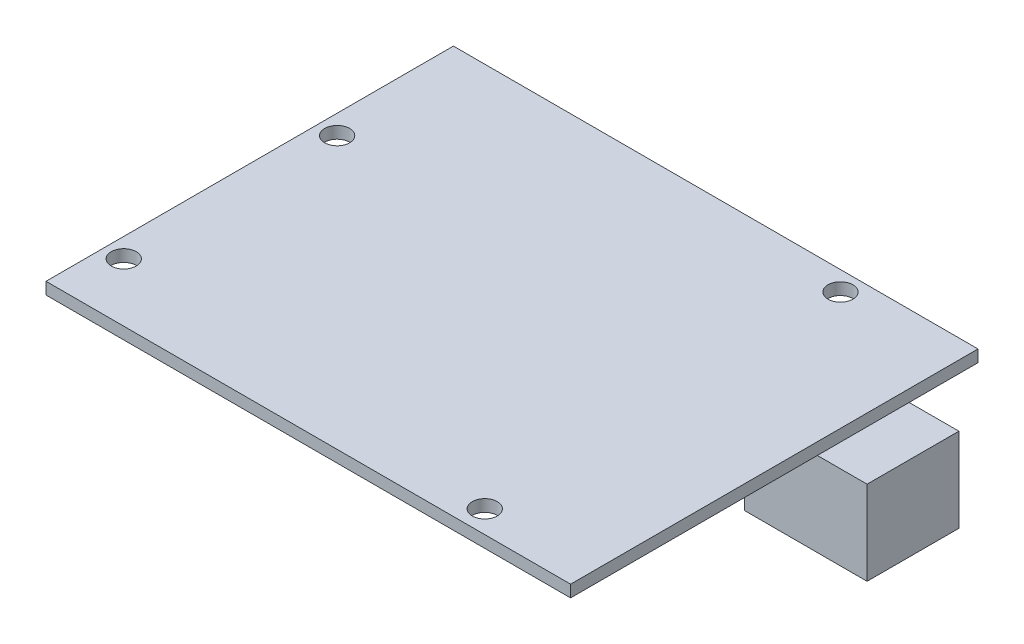
ISO-10303-21;
HEADER;
FILE_DESCRIPTION(('STEP AP214'),'2;1');
FILE_NAME('part.step','',(''),(''),'','','');
FILE_SCHEMA(('AUTOMOTIVE_DESIGN { 1 0 10303 214 1 1 1 1 }'));
ENDSEC;
DATA;
#1=APPLICATION_CONTEXT('core data for automotive mechanical design processes');
#2=APPLICATION_PROTOCOL_DEFINITION('international standard','automotive_design',2000,#1);
#3=PRODUCT_CONTEXT('',#1,'mechanical');
#4=PRODUCT('Part','Part','',(#3));
#5=PRODUCT_RELATED_PRODUCT_CATEGORY('part','',(#4));
#6=PRODUCT_DEFINITION_FORMATION('','',#4);
#7=PRODUCT_DEFINITION_CONTEXT('part definition',#1,'design');
#8=PRODUCT_DEFINITION('design','',#6,#7);
#9=PRODUCT_DEFINITION_SHAPE('','',#8);
#10=(LENGTH_UNIT() NAMED_UNIT(*) SI_UNIT(.MILLI.,.METRE.));
#11=(NAMED_UNIT(*) PLANE_ANGLE_UNIT() SI_UNIT($,.RADIAN.));
#12=(NAMED_UNIT(*) SI_UNIT($,.STERADIAN.) SOLID_ANGLE_UNIT());
#13=UNCERTAINTY_MEASURE_WITH_UNIT(LENGTH_MEASURE(1.E-05),#10,'distance_accuracy_value','');
#14=(GEOMETRIC_REPRESENTATION_CONTEXT(3) GLOBAL_UNCERTAINTY_ASSIGNED_CONTEXT((#13)) GLOBAL_UNIT_ASSIGNED_CONTEXT((#10,
#11,#12)) REPRESENTATION_CONTEXT('',''));
#15=CARTESIAN_POINT('',(0.,0.,0.));
#16=DIRECTION('',(0.,0.,1.));
#17=DIRECTION('',(1.,0.,0.));
#18=AXIS2_PLACEMENT_3D('',#15,#16,#17);
#19=CARTESIAN_POINT('',(0.,1.56,0.));
#20=DIRECTION('',(0.,-1.,0.));
#21=DIRECTION('',(0.,0.,-1.));
#22=AXIS2_PLACEMENT_3D('',#19,#20,#21);
#23=PLANE('',#22);
#24=DIRECTION('',(0.,0.,1.));
#25=VECTOR('',#24,1.);
#26=CARTESIAN_POINT('',(-2.54,1.56,-45.64));
#27=LINE('',#26,#25);
#28=CARTESIAN_POINT('',(-2.54,1.56,-45.64));
#29=VERTEX_POINT('',#28);
#30=CARTESIAN_POINT('',(-2.53999999999999,1.56,7.62));
#31=VERTEX_POINT('',#30);
#32=EDGE_CURVE('E160',#29,#31,#27,.T.);
#33=ORIENTED_EDGE('',*,*,#32,.T.);
#34=DIRECTION('',(1.,0.,0.));
#35=VECTOR('',#34,1.);
#36=CARTESIAN_POINT('',(66.04,1.56,7.61999999999999));
#37=LINE('',#36,#35);
#38=CARTESIAN_POINT('',(66.04,1.56,7.61999999999999));
#39=VERTEX_POINT('',#38);
#40=EDGE_CURVE('E163',#31,#39,#37,.T.);
#41=ORIENTED_EDGE('',*,*,#40,.T.);
#42=DIRECTION('',(0.,0.,-1.));
#43=VECTOR('',#42,1.);
#44=CARTESIAN_POINT('',(66.04,1.56,-45.64));
#45=LINE('',#44,#43);
#46=CARTESIAN_POINT('',(66.04,1.56,-45.64));
#47=VERTEX_POINT('',#46);
#48=EDGE_CURVE('E166',#39,#47,#45,.T.);
#49=ORIENTED_EDGE('',*,*,#48,.T.);
#50=DIRECTION('',(-1.,0.,0.));
#51=VECTOR('',#50,1.);
#52=CARTESIAN_POINT('',(66.04,1.56,-45.64));
#53=LINE('',#52,#51);
#54=EDGE_CURVE('E168',#47,#29,#53,.T.);
#55=ORIENTED_EDGE('',*,*,#54,.T.);
#56=EDGE_LOOP('',(#33,#41,#49,#55));
#57=FACE_BOUND('',#56,.T.);
#58=CARTESIAN_POINT('',(0.,1.56,0.));
#59=DIRECTION('',(0.,1.,0.));
#60=DIRECTION('',(0.,0.,1.));
#61=AXIS2_PLACEMENT_3D('',#58,#59,#60);
#62=CIRCLE('',#61,1.63195);
#63=CARTESIAN_POINT('',(0.,1.56,1.63195));
#64=VERTEX_POINT('',#63);
#65=EDGE_CURVE('E154',#64,#64,#62,.T.);
#66=ORIENTED_EDGE('',*,*,#65,.F.);
#67=EDGE_LOOP('',(#66));
#68=FACE_BOUND('',#67,.T.);
#69=CARTESIAN_POINT('',(0.,1.56,-27.9));
#70=DIRECTION('',(0.,1.,0.));
#71=DIRECTION('',(0.,0.,1.));
#72=AXIS2_PLACEMENT_3D('',#69,#70,#71);
#73=CIRCLE('',#72,1.63195);
#74=CARTESIAN_POINT('',(0.,1.56,-26.26805));
#75=VERTEX_POINT('',#74);
#76=EDGE_CURVE('E148',#75,#75,#73,.T.);
#77=ORIENTED_EDGE('',*,*,#76,.F.);
#78=EDGE_LOOP('',(#77));
#79=FACE_BOUND('',#78,.T.);
#80=CARTESIAN_POINT('',(51.9,1.56,4.7));
#81=DIRECTION('',(0.,1.,0.));
#82=DIRECTION('',(0.,0.,1.));
#83=AXIS2_PLACEMENT_3D('',#80,#81,#82);
#84=CIRCLE('',#83,1.63194999999999);
#85=CARTESIAN_POINT('',(51.9,1.56,6.33194999999999));
#86=VERTEX_POINT('',#85);
#87=EDGE_CURVE('E142',#86,#86,#84,.T.);
#88=ORIENTED_EDGE('',*,*,#87,.F.);
#89=EDGE_LOOP('',(#88));
#90=FACE_BOUND('',#89,.T.);
#91=CARTESIAN_POINT('',(50.6,1.56,-43.1));
#92=DIRECTION('',(0.,1.,0.));
#93=DIRECTION('',(0.,0.,1.));
#94=AXIS2_PLACEMENT_3D('',#91,#92,#93);
#95=CIRCLE('',#94,1.63195);
#96=CARTESIAN_POINT('',(50.6,1.56,-41.46805));
#97=VERTEX_POINT('',#96);
#98=EDGE_CURVE('E133',#97,#97,#95,.T.);
#99=ORIENTED_EDGE('',*,*,#98,.F.);
#100=EDGE_LOOP('',(#99));
#101=FACE_BOUND('',#100,.T.);
#102=ADVANCED_FACE('F33',(#57,#68,#79,#90,#101),#23,.F.);
#103=CARTESIAN_POINT('',(0.,0.,0.));
#104=DIRECTION('',(0.,-1.,0.));
#105=DIRECTION('',(0.,0.,-1.));
#106=AXIS2_PLACEMENT_3D('',#103,#104,#105);
#107=PLANE('',#106);
#108=DIRECTION('',(1.,0.,0.));
#109=VECTOR('',#108,1.);
#110=CARTESIAN_POINT('',(56.54,0.,-36.64));
#111=LINE('',#110,#109);
#112=CARTESIAN_POINT('',(56.54,0.,-36.64));
#113=VERTEX_POINT('',#112);
#114=CARTESIAN_POINT('',(66.04,0.,-36.64));
#115=VERTEX_POINT('',#114);
#116=EDGE_CURVE('E50',#113,#115,#111,.T.);
#117=ORIENTED_EDGE('',*,*,#116,.F.);
#118=DIRECTION('',(0.,0.,-1.));
#119=VECTOR('',#118,1.);
#120=CARTESIAN_POINT('',(56.54,0.,-24.64));
#121=LINE('',#120,#119);
#122=CARTESIAN_POINT('',(56.54,0.,-24.64));
#123=VERTEX_POINT('',#122);
#124=EDGE_CURVE('E206',#123,#113,#121,.T.);
#125=ORIENTED_EDGE('',*,*,#124,.F.);
#126=DIRECTION('',(-1.,0.,0.));
#127=VECTOR('',#126,1.);
#128=CARTESIAN_POINT('',(56.54,0.,-24.64));
#129=LINE('',#128,#127);
#130=CARTESIAN_POINT('',(66.04,0.,-24.64));
#131=VERTEX_POINT('',#130);
#132=EDGE_CURVE('E11',#131,#123,#129,.T.);
#133=ORIENTED_EDGE('',*,*,#132,.F.);
#134=DIRECTION('',(0.,0.,-1.));
#135=VECTOR('',#134,1.);
#136=CARTESIAN_POINT('',(66.04,0.,-45.64));
#137=LINE('',#136,#135);
#138=CARTESIAN_POINT('',(66.04,0.,7.61999999999999));
#139=VERTEX_POINT('',#138);
#140=EDGE_CURVE('E175',#139,#131,#137,.T.);
#141=ORIENTED_EDGE('',*,*,#140,.F.);
#142=DIRECTION('',(1.,0.,0.));
#143=VECTOR('',#142,1.);
#144=CARTESIAN_POINT('',(66.04,0.,7.61999999999999));
#145=LINE('',#144,#143);
#146=CARTESIAN_POINT('',(-2.53999999999999,0.,7.62));
#147=VERTEX_POINT('',#146);
#148=EDGE_CURVE('E173',#147,#139,#145,.T.);
#149=ORIENTED_EDGE('',*,*,#148,.F.);
#150=DIRECTION('',(0.,0.,1.));
#151=VECTOR('',#150,1.);
#152=CARTESIAN_POINT('',(-2.54,0.,-45.64));
#153=LINE('',#152,#151);
#154=CARTESIAN_POINT('',(-2.54,0.,-45.64));
#155=VERTEX_POINT('',#154);
#156=EDGE_CURVE('E157',#155,#147,#153,.T.);
#157=ORIENTED_EDGE('',*,*,#156,.F.);
#158=DIRECTION('',(-1.,0.,0.));
#159=VECTOR('',#158,1.);
#160=CARTESIAN_POINT('',(66.04,0.,-45.64));
#161=LINE('',#160,#159);
#162=CARTESIAN_POINT('',(66.04,0.,-45.64));
#163=VERTEX_POINT('',#162);
#164=EDGE_CURVE('E164',#163,#155,#161,.T.);
#165=ORIENTED_EDGE('',*,*,#164,.F.);
#166=EDGE_CURVE('E55',#115,#163,#137,.T.);
#167=ORIENTED_EDGE('',*,*,#166,.F.);
#168=EDGE_LOOP('',(#117,#125,#133,#141,#149,#157,#165,#167));
#169=FACE_BOUND('',#168,.T.);
#170=CARTESIAN_POINT('',(51.9,0.,4.7));
#171=DIRECTION('',(0.,1.,0.));
#172=DIRECTION('',(0.,0.,1.));
#173=AXIS2_PLACEMENT_3D('',#170,#171,#172);
#174=CIRCLE('',#173,1.63194999999999);
#175=CARTESIAN_POINT('',(51.9,0.,6.33194999999999));
#176=VERTEX_POINT('',#175);
#177=EDGE_CURVE('E140',#176,#176,#174,.T.);
#178=ORIENTED_EDGE('',*,*,#177,.T.);
#179=EDGE_LOOP('',(#178));
#180=FACE_BOUND('',#179,.T.);
#181=CARTESIAN_POINT('',(0.,0.,0.));
#182=DIRECTION('',(0.,1.,0.));
#183=DIRECTION('',(0.,0.,1.));
#184=AXIS2_PLACEMENT_3D('',#181,#182,#183);
#185=CIRCLE('',#184,1.63195);
#186=CARTESIAN_POINT('',(0.,0.,1.63195));
#187=VERTEX_POINT('',#186);
#188=EDGE_CURVE('E151',#187,#187,#185,.T.);
#189=ORIENTED_EDGE('',*,*,#188,.T.);
#190=EDGE_LOOP('',(#189));
#191=FACE_BOUND('',#190,.T.);
#192=CARTESIAN_POINT('',(0.,0.,-27.9));
#193=DIRECTION('',(0.,1.,0.));
#194=DIRECTION('',(0.,0.,1.));
#195=AXIS2_PLACEMENT_3D('',#192,#193,#194);
#196=CIRCLE('',#195,1.63195);
#197=CARTESIAN_POINT('',(0.,0.,-26.26805));
#198=VERTEX_POINT('',#197);
#199=EDGE_CURVE('E145',#198,#198,#196,.T.);
#200=ORIENTED_EDGE('',*,*,#199,.T.);
#201=EDGE_LOOP('',(#200));
#202=FACE_BOUND('',#201,.T.);
#203=CARTESIAN_POINT('',(50.6,0.,-43.1));
#204=DIRECTION('',(0.,1.,0.));
#205=DIRECTION('',(0.,0.,1.));
#206=AXIS2_PLACEMENT_3D('',#203,#204,#205);
#207=CIRCLE('',#206,1.63195);
#208=CARTESIAN_POINT('',(50.6,0.,-41.46805));
#209=VERTEX_POINT('',#208);
#210=EDGE_CURVE('E130',#209,#209,#207,.T.);
#211=ORIENTED_EDGE('',*,*,#210,.T.);
#212=EDGE_LOOP('',(#211));
#213=FACE_BOUND('',#212,.T.);
#214=ADVANCED_FACE('F198',(#169,#180,#191,#202,#213),#107,.T.);
#215=CARTESIAN_POINT('',(-2.54,1.56,-45.64));
#216=DIRECTION('',(1.,0.,0.));
#217=DIRECTION('',(0.,0.,-1.));
#218=AXIS2_PLACEMENT_3D('',#215,#216,#217);
#219=PLANE('',#218);
#220=ORIENTED_EDGE('',*,*,#156,.T.);
#221=DIRECTION('',(0.,-1.,0.));
#222=VECTOR('',#221,1.);
#223=CARTESIAN_POINT('',(-2.53999999999999,1.56,7.62));
#224=LINE('',#223,#222);
#225=EDGE_CURVE('E37',#31,#147,#224,.T.);
#226=ORIENTED_EDGE('',*,*,#225,.F.);
#227=ORIENTED_EDGE('',*,*,#32,.F.);
#228=DIRECTION('',(0.,-1.,0.));
#229=VECTOR('',#228,1.);
#230=CARTESIAN_POINT('',(-2.54,1.56,-45.64));
#231=LINE('',#230,#229);
#232=EDGE_CURVE('E170',#29,#155,#231,.T.);
#233=ORIENTED_EDGE('',*,*,#232,.T.);
#234=EDGE_LOOP('',(#220,#226,#227,#233));
#235=FACE_BOUND('',#234,.T.);
#236=ADVANCED_FACE('F35',(#235),#219,.F.);
#237=CARTESIAN_POINT('',(66.04,1.56,7.61999999999999));
#238=DIRECTION('',(0.,0.,-1.));
#239=DIRECTION('',(-1.,0.,0.));
#240=AXIS2_PLACEMENT_3D('',#237,#238,#239);
#241=PLANE('',#240);
#242=ORIENTED_EDGE('',*,*,#148,.T.);
#243=DIRECTION('',(0.,-1.,0.));
#244=VECTOR('',#243,1.);
#245=CARTESIAN_POINT('',(66.04,1.56,7.61999999999999));
#246=LINE('',#245,#244);
#247=EDGE_CURVE('E184',#39,#139,#246,.T.);
#248=ORIENTED_EDGE('',*,*,#247,.F.);
#249=ORIENTED_EDGE('',*,*,#40,.F.);
#250=ORIENTED_EDGE('',*,*,#225,.T.);
#251=EDGE_LOOP('',(#242,#248,#249,#250));
#252=FACE_BOUND('',#251,.T.);
#253=ADVANCED_FACE('F193',(#252),#241,.F.);
#254=CARTESIAN_POINT('',(66.04,1.56,-45.64));
#255=DIRECTION('',(-1.,0.,0.));
#256=DIRECTION('',(0.,0.,1.));
#257=AXIS2_PLACEMENT_3D('',#254,#255,#256);
#258=PLANE('',#257);
#259=ORIENTED_EDGE('',*,*,#140,.T.);
#260=EDGE_CURVE('E178',#131,#115,#137,.T.);
#261=ORIENTED_EDGE('',*,*,#260,.T.);
#262=ORIENTED_EDGE('',*,*,#166,.T.);
#263=DIRECTION('',(0.,-1.,0.));
#264=VECTOR('',#263,1.);
#265=CARTESIAN_POINT('',(66.04,1.56,-45.64));
#266=LINE('',#265,#264);
#267=EDGE_CURVE('E182',#47,#163,#266,.T.);
#268=ORIENTED_EDGE('',*,*,#267,.F.);
#269=ORIENTED_EDGE('',*,*,#48,.F.);
#270=ORIENTED_EDGE('',*,*,#247,.T.);
#271=EDGE_LOOP('',(#259,#261,#262,#268,#269,#270));
#272=FACE_BOUND('',#271,.T.);
#273=ADVANCED_FACE('F201',(#272),#258,.F.);
#274=CARTESIAN_POINT('',(66.04,1.56,-45.64));
#275=DIRECTION('',(0.,0.,1.));
#276=DIRECTION('',(1.,0.,0.));
#277=AXIS2_PLACEMENT_3D('',#274,#275,#276);
#278=PLANE('',#277);
#279=ORIENTED_EDGE('',*,*,#164,.T.);
#280=ORIENTED_EDGE('',*,*,#232,.F.);
#281=ORIENTED_EDGE('',*,*,#54,.F.);
#282=ORIENTED_EDGE('',*,*,#267,.T.);
#283=EDGE_LOOP('',(#279,#280,#281,#282));
#284=FACE_BOUND('',#283,.T.);
#285=ADVANCED_FACE('F240',(#284),#278,.F.);
#286=CARTESIAN_POINT('',(0.,1.56,0.));
#287=DIRECTION('',(0.,-1.,0.));
#288=DIRECTION('',(0.,0.,-1.));
#289=AXIS2_PLACEMENT_3D('',#286,#287,#288);
#290=CYLINDRICAL_SURFACE('',#289,1.63195);
#291=ORIENTED_EDGE('',*,*,#65,.T.);
#292=EDGE_LOOP('',(#291));
#293=FACE_BOUND('',#292,.T.);
#294=ORIENTED_EDGE('',*,*,#188,.F.);
#295=EDGE_LOOP('',(#294));
#296=FACE_BOUND('',#295,.T.);
#297=ADVANCED_FACE('F237',(#293,#296),#290,.F.);
#298=CARTESIAN_POINT('',(0.,1.56,-27.9));
#299=DIRECTION('',(0.,-1.,0.));
#300=DIRECTION('',(0.,0.,-1.));
#301=AXIS2_PLACEMENT_3D('',#298,#299,#300);
#302=CYLINDRICAL_SURFACE('',#301,1.63195);
#303=ORIENTED_EDGE('',*,*,#76,.T.);
#304=EDGE_LOOP('',(#303));
#305=FACE_BOUND('',#304,.T.);
#306=ORIENTED_EDGE('',*,*,#199,.F.);
#307=EDGE_LOOP('',(#306));
#308=FACE_BOUND('',#307,.T.);
#309=ADVANCED_FACE('F321',(#305,#308),#302,.F.);
#310=CARTESIAN_POINT('',(51.9,1.56,4.7));
#311=DIRECTION('',(0.,-1.,0.));
#312=DIRECTION('',(0.,0.,-1.));
#313=AXIS2_PLACEMENT_3D('',#310,#311,#312);
#314=CYLINDRICAL_SURFACE('',#313,1.63194999999999);
#315=ORIENTED_EDGE('',*,*,#87,.T.);
#316=EDGE_LOOP('',(#315));
#317=FACE_BOUND('',#316,.T.);
#318=ORIENTED_EDGE('',*,*,#177,.F.);
#319=EDGE_LOOP('',(#318));
#320=FACE_BOUND('',#319,.T.);
#321=ADVANCED_FACE('F316',(#317,#320),#314,.F.);
#322=CARTESIAN_POINT('',(50.6,1.56,-43.1));
#323=DIRECTION('',(0.,-1.,0.));
#324=DIRECTION('',(0.,0.,-1.));
#325=AXIS2_PLACEMENT_3D('',#322,#323,#324);
#326=CYLINDRICAL_SURFACE('',#325,1.63195);
#327=ORIENTED_EDGE('',*,*,#98,.T.);
#328=EDGE_LOOP('',(#327));
#329=FACE_BOUND('',#328,.T.);
#330=ORIENTED_EDGE('',*,*,#210,.F.);
#331=EDGE_LOOP('',(#330));
#332=FACE_BOUND('',#331,.T.);
#333=ADVANCED_FACE('F262',(#329,#332),#326,.F.);
#334=CARTESIAN_POINT('',(72.54,-11.,-24.64));
#335=DIRECTION('',(-1.,0.,0.));
#336=DIRECTION('',(0.,0.,1.));
#337=AXIS2_PLACEMENT_3D('',#334,#335,#336);
#338=PLANE('',#337);
#339=DIRECTION('',(0.,0.,1.));
#340=VECTOR('',#339,1.);
#341=CARTESIAN_POINT('',(72.54,0.,-24.64));
#342=LINE('',#341,#340);
#343=CARTESIAN_POINT('',(72.54,0.,-36.64));
#344=VERTEX_POINT('',#343);
#345=CARTESIAN_POINT('',(72.54,0.,-24.64));
#346=VERTEX_POINT('',#345);
#347=EDGE_CURVE('E129',#344,#346,#342,.T.);
#348=ORIENTED_EDGE('',*,*,#347,.T.);
#349=DIRECTION('',(0.,1.,0.));
#350=VECTOR('',#349,1.);
#351=CARTESIAN_POINT('',(72.54,-11.,-24.64));
#352=LINE('',#351,#350);
#353=CARTESIAN_POINT('',(72.54,-11.,-24.64));
#354=VERTEX_POINT('',#353);
#355=EDGE_CURVE('E110',#354,#346,#352,.T.);
#356=ORIENTED_EDGE('',*,*,#355,.F.);
#357=DIRECTION('',(0.,0.,1.));
#358=VECTOR('',#357,1.);
#359=CARTESIAN_POINT('',(72.54,-11.,-24.64));
#360=LINE('',#359,#358);
#361=CARTESIAN_POINT('',(72.54,-11.,-36.64));
#362=VERTEX_POINT('',#361);
#363=EDGE_CURVE('E117',#362,#354,#360,.T.);
#364=ORIENTED_EDGE('',*,*,#363,.F.);
#365=DIRECTION('',(0.,1.,0.));
#366=VECTOR('',#365,1.);
#367=CARTESIAN_POINT('',(72.54,-11.,-36.64));
#368=LINE('',#367,#366);
#369=EDGE_CURVE('E212',#362,#344,#368,.T.);
#370=ORIENTED_EDGE('',*,*,#369,.T.);
#371=EDGE_LOOP('',(#348,#356,#364,#370));
#372=FACE_BOUND('',#371,.T.);
#373=ADVANCED_FACE('F127',(#372),#338,.F.);
#374=CARTESIAN_POINT('',(56.54,-11.,-24.64));
#375=DIRECTION('',(0.,0.,-1.));
#376=DIRECTION('',(-1.,0.,0.));
#377=AXIS2_PLACEMENT_3D('',#374,#375,#376);
#378=PLANE('',#377);
#379=EDGE_CURVE('E43',#346,#131,#129,.T.);
#380=ORIENTED_EDGE('',*,*,#379,.T.);
#381=ORIENTED_EDGE('',*,*,#132,.T.);
#382=DIRECTION('',(0.,1.,0.));
#383=VECTOR('',#382,1.);
#384=CARTESIAN_POINT('',(56.54,-11.,-24.64));
#385=LINE('',#384,#383);
#386=CARTESIAN_POINT('',(56.54,-11.,-24.64));
#387=VERTEX_POINT('',#386);
#388=EDGE_CURVE('E113',#387,#123,#385,.T.);
#389=ORIENTED_EDGE('',*,*,#388,.F.);
#390=DIRECTION('',(-1.,0.,0.));
#391=VECTOR('',#390,1.);
#392=CARTESIAN_POINT('',(56.54,-11.,-24.64));
#393=LINE('',#392,#391);
#394=EDGE_CURVE('E105',#354,#387,#393,.T.);
#395=ORIENTED_EDGE('',*,*,#394,.F.);
#396=ORIENTED_EDGE('',*,*,#355,.T.);
#397=EDGE_LOOP('',(#380,#381,#389,#395,#396));
#398=FACE_BOUND('',#397,.T.);
#399=ADVANCED_FACE('F108',(#398),#378,.F.);
#400=CARTESIAN_POINT('',(56.54,-11.,-24.64));
#401=DIRECTION('',(1.,0.,0.));
#402=DIRECTION('',(0.,0.,-1.));
#403=AXIS2_PLACEMENT_3D('',#400,#401,#402);
#404=PLANE('',#403);
#405=ORIENTED_EDGE('',*,*,#124,.T.);
#406=DIRECTION('',(0.,1.,0.));
#407=VECTOR('',#406,1.);
#408=CARTESIAN_POINT('',(56.54,-11.,-36.64));
#409=LINE('',#408,#407);
#410=CARTESIAN_POINT('',(56.54,-11.,-36.64));
#411=VERTEX_POINT('',#410);
#412=EDGE_CURVE('E135',#411,#113,#409,.T.);
#413=ORIENTED_EDGE('',*,*,#412,.F.);
#414=DIRECTION('',(0.,0.,-1.));
#415=VECTOR('',#414,1.);
#416=CARTESIAN_POINT('',(56.54,-11.,-24.64));
#417=LINE('',#416,#415);
#418=EDGE_CURVE('E116',#387,#411,#417,.T.);
#419=ORIENTED_EDGE('',*,*,#418,.F.);
#420=ORIENTED_EDGE('',*,*,#388,.T.);
#421=EDGE_LOOP('',(#405,#413,#419,#420));
#422=FACE_BOUND('',#421,.T.);
#423=ADVANCED_FACE('F218',(#422),#404,.F.);
#424=CARTESIAN_POINT('',(56.54,-11.,-36.64));
#425=DIRECTION('',(0.,0.,1.));
#426=DIRECTION('',(1.,0.,0.));
#427=AXIS2_PLACEMENT_3D('',#424,#425,#426);
#428=PLANE('',#427);
#429=ORIENTED_EDGE('',*,*,#116,.T.);
#430=EDGE_CURVE('E205',#115,#344,#111,.T.);
#431=ORIENTED_EDGE('',*,*,#430,.T.);
#432=ORIENTED_EDGE('',*,*,#369,.F.);
#433=DIRECTION('',(1.,0.,0.));
#434=VECTOR('',#433,1.);
#435=CARTESIAN_POINT('',(56.54,-11.,-36.64));
#436=LINE('',#435,#434);
#437=EDGE_CURVE('E122',#411,#362,#436,.T.);
#438=ORIENTED_EDGE('',*,*,#437,.F.);
#439=ORIENTED_EDGE('',*,*,#412,.T.);
#440=EDGE_LOOP('',(#429,#431,#432,#438,#439));
#441=FACE_BOUND('',#440,.T.);
#442=ADVANCED_FACE('F216',(#441),#428,.F.);
#443=CARTESIAN_POINT('',(0.,-11.,0.));
#444=DIRECTION('',(0.,-1.,0.));
#445=DIRECTION('',(0.,0.,-1.));
#446=AXIS2_PLACEMENT_3D('',#443,#444,#445);
#447=PLANE('',#446);
#448=ORIENTED_EDGE('',*,*,#363,.T.);
#449=ORIENTED_EDGE('',*,*,#394,.T.);
#450=ORIENTED_EDGE('',*,*,#418,.T.);
#451=ORIENTED_EDGE('',*,*,#437,.T.);
#452=EDGE_LOOP('',(#448,#449,#450,#451));
#453=FACE_BOUND('',#452,.T.);
#454=ADVANCED_FACE('F120',(#453),#447,.T.);
#455=CARTESIAN_POINT('',(0.,0.,0.));
#456=DIRECTION('',(0.,-1.,0.));
#457=DIRECTION('',(0.,0.,-1.));
#458=AXIS2_PLACEMENT_3D('',#455,#456,#457);
#459=PLANE('',#458);
#460=ORIENTED_EDGE('',*,*,#260,.F.);
#461=ORIENTED_EDGE('',*,*,#379,.F.);
#462=ORIENTED_EDGE('',*,*,#347,.F.);
#463=ORIENTED_EDGE('',*,*,#430,.F.);
#464=EDGE_LOOP('',(#460,#461,#462,#463));
#465=FACE_BOUND('',#464,.T.);
#466=ADVANCED_FACE('F204',(#465),#459,.F.);
#467=CLOSED_SHELL('',(#102,#214,#236,#253,#273,#285,#297,#309,#321,#333,#373,#399,#423,#442,
#454,#466));
#468=MANIFOLD_SOLID_BREP('B2',#467);
#469=ADVANCED_BREP_SHAPE_REPRESENTATION('',(#18,#468),#14);
#470=SHAPE_DEFINITION_REPRESENTATION(#9,#469);
ENDSEC;
END-ISO-10303-21;
